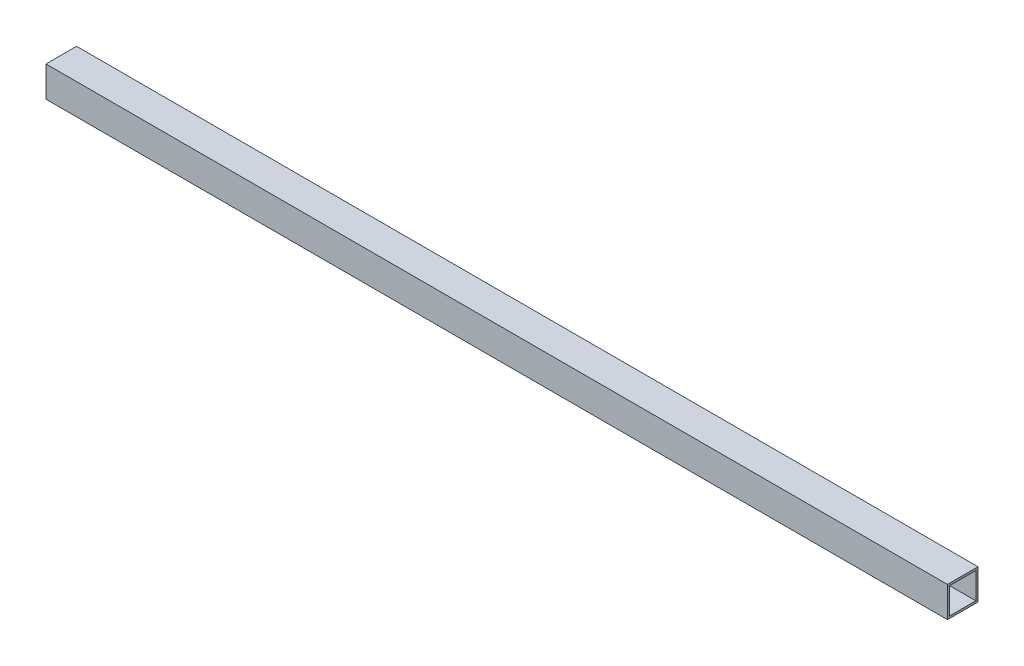
ISO-10303-21;
HEADER;
FILE_DESCRIPTION(('STEP AP214'),'2;1');
FILE_NAME('part.step','',(''),(''),'','','');
FILE_SCHEMA(('AUTOMOTIVE_DESIGN { 1 0 10303 214 1 1 1 1 }'));
ENDSEC;
DATA;
#1=APPLICATION_CONTEXT('core data for automotive mechanical design processes');
#2=APPLICATION_PROTOCOL_DEFINITION('international standard','automotive_design',2000,#1);
#3=PRODUCT_CONTEXT('',#1,'mechanical');
#4=PRODUCT('Part','Part','',(#3));
#5=PRODUCT_RELATED_PRODUCT_CATEGORY('part','',(#4));
#6=PRODUCT_DEFINITION_FORMATION('','',#4);
#7=PRODUCT_DEFINITION_CONTEXT('part definition',#1,'design');
#8=PRODUCT_DEFINITION('design','',#6,#7);
#9=PRODUCT_DEFINITION_SHAPE('','',#8);
#10=(LENGTH_UNIT() NAMED_UNIT(*) SI_UNIT(.MILLI.,.METRE.));
#11=(NAMED_UNIT(*) PLANE_ANGLE_UNIT() SI_UNIT($,.RADIAN.));
#12=(NAMED_UNIT(*) SI_UNIT($,.STERADIAN.) SOLID_ANGLE_UNIT());
#13=UNCERTAINTY_MEASURE_WITH_UNIT(LENGTH_MEASURE(1.E-05),#10,'distance_accuracy_value','');
#14=(GEOMETRIC_REPRESENTATION_CONTEXT(3) GLOBAL_UNCERTAINTY_ASSIGNED_CONTEXT((#13)) GLOBAL_UNIT_ASSIGNED_CONTEXT((#10,
#11,#12)) REPRESENTATION_CONTEXT('',''));
#15=CARTESIAN_POINT('',(0.,0.,0.));
#16=DIRECTION('',(0.,0.,1.));
#17=DIRECTION('',(1.,0.,0.));
#18=AXIS2_PLACEMENT_3D('',#15,#16,#17);
#19=CARTESIAN_POINT('',(-192.0875,-809.625,-19.05));
#20=DIRECTION('',(0.,0.,-1.));
#21=DIRECTION('',(-1.,0.,0.));
#22=AXIS2_PLACEMENT_3D('',#19,#20,#21);
#23=PLANE('',#22);
#24=DIRECTION('',(0.,1.,0.));
#25=VECTOR('',#24,1.);
#26=CARTESIAN_POINT('',(-847.725,-809.625,-19.05));
#27=LINE('',#26,#25);
#28=CARTESIAN_POINT('',(-847.725,-806.45,-19.05));
#29=VERTEX_POINT('',#28);
#30=CARTESIAN_POINT('',(-847.725,-768.35,-19.05));
#31=VERTEX_POINT('',#30);
#32=EDGE_CURVE('E127',#29,#31,#27,.T.);
#33=ORIENTED_EDGE('',*,*,#32,.F.);
#34=DIRECTION('',(1.,0.,0.));
#35=VECTOR('',#34,1.);
#36=CARTESIAN_POINT('',(-192.0875,-806.45,-19.05));
#37=LINE('',#36,#35);
#38=CARTESIAN_POINT('',(463.55,-806.45,-19.05));
#39=VERTEX_POINT('',#38);
#40=EDGE_CURVE('E89',#29,#39,#37,.T.);
#41=ORIENTED_EDGE('',*,*,#40,.T.);
#42=DIRECTION('',(0.,1.,0.));
#43=VECTOR('',#42,1.);
#44=CARTESIAN_POINT('',(463.55,-809.625,-19.05));
#45=LINE('',#44,#43);
#46=CARTESIAN_POINT('',(463.55,-768.35,-19.05));
#47=VERTEX_POINT('',#46);
#48=EDGE_CURVE('E99',#39,#47,#45,.T.);
#49=ORIENTED_EDGE('',*,*,#48,.T.);
#50=DIRECTION('',(1.,0.,0.));
#51=VECTOR('',#50,1.);
#52=CARTESIAN_POINT('',(-192.0875,-768.35,-19.05));
#53=LINE('',#52,#51);
#54=EDGE_CURVE('E17',#31,#47,#53,.T.);
#55=ORIENTED_EDGE('',*,*,#54,.F.);
#56=EDGE_LOOP('',(#33,#41,#49,#55));
#57=FACE_BOUND('',#56,.T.);
#58=ADVANCED_FACE('F14',(#57),#23,.F.);
#59=CARTESIAN_POINT('',(-192.0875,-768.35,0.));
#60=DIRECTION('',(0.,-1.,0.));
#61=DIRECTION('',(0.,0.,-1.));
#62=AXIS2_PLACEMENT_3D('',#59,#60,#61);
#63=PLANE('',#62);
#64=DIRECTION('',(-1.,0.,0.));
#65=VECTOR('',#64,1.);
#66=CARTESIAN_POINT('',(-192.0875,-768.35,19.05));
#67=LINE('',#66,#65);
#68=CARTESIAN_POINT('',(-847.725,-768.35,19.05));
#69=VERTEX_POINT('',#68);
#70=CARTESIAN_POINT('',(463.55,-768.35,19.05));
#71=VERTEX_POINT('',#70);
#72=EDGE_CURVE('E76',#69,#71,#67,.F.);
#73=ORIENTED_EDGE('',*,*,#72,.F.);
#74=DIRECTION('',(0.,0.,1.));
#75=VECTOR('',#74,1.);
#76=CARTESIAN_POINT('',(-847.725,-768.35,-1.00613961606655E-13));
#77=LINE('',#76,#75);
#78=EDGE_CURVE('E112',#31,#69,#77,.T.);
#79=ORIENTED_EDGE('',*,*,#78,.F.);
#80=ORIENTED_EDGE('',*,*,#54,.T.);
#81=DIRECTION('',(0.,0.,1.));
#82=VECTOR('',#81,1.);
#83=CARTESIAN_POINT('',(463.55,-768.35,0.));
#84=LINE('',#83,#82);
#85=EDGE_CURVE('E111',#47,#71,#84,.T.);
#86=ORIENTED_EDGE('',*,*,#85,.T.);
#87=EDGE_LOOP('',(#73,#79,#80,#86));
#88=FACE_BOUND('',#87,.T.);
#89=ADVANCED_FACE('F110',(#88),#63,.T.);
#90=CARTESIAN_POINT('',(-192.0875,-809.625,19.05));
#91=DIRECTION('',(0.,0.,-1.));
#92=DIRECTION('',(-1.,0.,0.));
#93=AXIS2_PLACEMENT_3D('',#90,#91,#92);
#94=PLANE('',#93);
#95=DIRECTION('',(1.,0.,0.));
#96=VECTOR('',#95,1.);
#97=CARTESIAN_POINT('',(-192.0875,-806.45,19.05));
#98=LINE('',#97,#96);
#99=CARTESIAN_POINT('',(463.55,-806.45,19.05));
#100=VERTEX_POINT('',#99);
#101=CARTESIAN_POINT('',(-847.725,-806.45,19.05));
#102=VERTEX_POINT('',#101);
#103=EDGE_CURVE('E83',#100,#102,#98,.F.);
#104=ORIENTED_EDGE('',*,*,#103,.T.);
#105=DIRECTION('',(0.,1.,0.));
#106=VECTOR('',#105,1.);
#107=CARTESIAN_POINT('',(-847.725,-809.625,19.05));
#108=LINE('',#107,#106);
#109=EDGE_CURVE('E130',#69,#102,#108,.F.);
#110=ORIENTED_EDGE('',*,*,#109,.F.);
#111=ORIENTED_EDGE('',*,*,#72,.T.);
#112=DIRECTION('',(0.,1.,0.));
#113=VECTOR('',#112,1.);
#114=CARTESIAN_POINT('',(463.55,-809.625,19.05));
#115=LINE('',#114,#113);
#116=EDGE_CURVE('E96',#71,#100,#115,.F.);
#117=ORIENTED_EDGE('',*,*,#116,.T.);
#118=EDGE_LOOP('',(#104,#110,#111,#117));
#119=FACE_BOUND('',#118,.T.);
#120=ADVANCED_FACE('F101',(#119),#94,.T.);
#121=CARTESIAN_POINT('',(-192.0875,-806.45,0.));
#122=DIRECTION('',(0.,-1.,0.));
#123=DIRECTION('',(0.,0.,-1.));
#124=AXIS2_PLACEMENT_3D('',#121,#122,#123);
#125=PLANE('',#124);
#126=DIRECTION('',(0.,0.,1.));
#127=VECTOR('',#126,1.);
#128=CARTESIAN_POINT('',(-847.725,-806.45,-1.00613961606655E-13));
#129=LINE('',#128,#127);
#130=EDGE_CURVE('E88',#102,#29,#129,.F.);
#131=ORIENTED_EDGE('',*,*,#130,.F.);
#132=ORIENTED_EDGE('',*,*,#103,.F.);
#133=DIRECTION('',(0.,0.,1.));
#134=VECTOR('',#133,1.);
#135=CARTESIAN_POINT('',(463.55,-806.45,0.));
#136=LINE('',#135,#134);
#137=EDGE_CURVE('E86',#100,#39,#136,.F.);
#138=ORIENTED_EDGE('',*,*,#137,.T.);
#139=ORIENTED_EDGE('',*,*,#40,.F.);
#140=EDGE_LOOP('',(#131,#132,#138,#139));
#141=FACE_BOUND('',#140,.T.);
#142=ADVANCED_FACE('F85',(#141),#125,.F.);
#143=CARTESIAN_POINT('',(-192.0875,-809.625,0.));
#144=DIRECTION('',(0.,-1.,0.));
#145=DIRECTION('',(0.,0.,-1.));
#146=AXIS2_PLACEMENT_3D('',#143,#144,#145);
#147=PLANE('',#146);
#148=DIRECTION('',(-1.,0.,0.));
#149=VECTOR('',#148,1.);
#150=CARTESIAN_POINT('',(-192.0875,-809.625,22.225));
#151=LINE('',#150,#149);
#152=CARTESIAN_POINT('',(463.55,-809.625,22.225));
#153=VERTEX_POINT('',#152);
#154=CARTESIAN_POINT('',(-847.725,-809.625,22.225));
#155=VERTEX_POINT('',#154);
#156=EDGE_CURVE('E120',#153,#155,#151,.T.);
#157=ORIENTED_EDGE('',*,*,#156,.T.);
#158=DIRECTION('',(0.,0.,1.));
#159=VECTOR('',#158,1.);
#160=CARTESIAN_POINT('',(-847.725,-809.625,-1.00613961606655E-13));
#161=LINE('',#160,#159);
#162=CARTESIAN_POINT('',(-847.725,-809.625,-22.225));
#163=VERTEX_POINT('',#162);
#164=EDGE_CURVE('E123',#163,#155,#161,.T.);
#165=ORIENTED_EDGE('',*,*,#164,.F.);
#166=DIRECTION('',(-1.,0.,0.));
#167=VECTOR('',#166,1.);
#168=CARTESIAN_POINT('',(-192.0875,-809.625,-22.225));
#169=LINE('',#168,#167);
#170=CARTESIAN_POINT('',(463.55,-809.625,-22.225));
#171=VERTEX_POINT('',#170);
#172=EDGE_CURVE('E136',#171,#163,#169,.T.);
#173=ORIENTED_EDGE('',*,*,#172,.F.);
#174=DIRECTION('',(0.,0.,1.));
#175=VECTOR('',#174,1.);
#176=CARTESIAN_POINT('',(463.55,-809.625,0.));
#177=LINE('',#176,#175);
#178=EDGE_CURVE('E102',#171,#153,#177,.T.);
#179=ORIENTED_EDGE('',*,*,#178,.T.);
#180=EDGE_LOOP('',(#157,#165,#173,#179));
#181=FACE_BOUND('',#180,.T.);
#182=ADVANCED_FACE('F175',(#181),#147,.T.);
#183=CARTESIAN_POINT('',(463.55,-809.625,0.));
#184=DIRECTION('',(-1.,0.,0.));
#185=DIRECTION('',(0.,0.,1.));
#186=AXIS2_PLACEMENT_3D('',#183,#184,#185);
#187=PLANE('',#186);
#188=ORIENTED_EDGE('',*,*,#48,.F.);
#189=ORIENTED_EDGE('',*,*,#137,.F.);
#190=ORIENTED_EDGE('',*,*,#116,.F.);
#191=ORIENTED_EDGE('',*,*,#85,.F.);
#192=EDGE_LOOP('',(#188,#189,#190,#191));
#193=FACE_BOUND('',#192,.T.);
#194=DIRECTION('',(0.,1.,0.));
#195=VECTOR('',#194,1.);
#196=CARTESIAN_POINT('',(463.55,-809.625,22.2250000000001));
#197=LINE('',#196,#195);
#198=CARTESIAN_POINT('',(463.55,-765.175,22.225));
#199=VERTEX_POINT('',#198);
#200=EDGE_CURVE('E115',#199,#153,#197,.F.);
#201=ORIENTED_EDGE('',*,*,#200,.T.);
#202=ORIENTED_EDGE('',*,*,#178,.F.);
#203=DIRECTION('',(0.,1.,0.));
#204=VECTOR('',#203,1.);
#205=CARTESIAN_POINT('',(463.55,-809.625,-22.2249999999999));
#206=LINE('',#205,#204);
#207=CARTESIAN_POINT('',(463.55,-765.175,-22.225));
#208=VERTEX_POINT('',#207);
#209=EDGE_CURVE('E133',#208,#171,#206,.F.);
#210=ORIENTED_EDGE('',*,*,#209,.F.);
#211=DIRECTION('',(0.,0.,-1.));
#212=VECTOR('',#211,1.);
#213=CARTESIAN_POINT('',(463.55,-765.175,0.));
#214=LINE('',#213,#212);
#215=EDGE_CURVE('E139',#208,#199,#214,.F.);
#216=ORIENTED_EDGE('',*,*,#215,.T.);
#217=EDGE_LOOP('',(#201,#202,#210,#216));
#218=FACE_BOUND('',#217,.T.);
#219=ADVANCED_FACE('F93',(#193,#218),#187,.F.);
#220=CARTESIAN_POINT('',(-192.0875,-809.625,22.225));
#221=DIRECTION('',(0.,0.,-1.));
#222=DIRECTION('',(-1.,0.,0.));
#223=AXIS2_PLACEMENT_3D('',#220,#221,#222);
#224=PLANE('',#223);
#225=DIRECTION('',(0.,1.,0.));
#226=VECTOR('',#225,1.);
#227=CARTESIAN_POINT('',(-847.725,-809.625,22.225));
#228=LINE('',#227,#226);
#229=CARTESIAN_POINT('',(-847.725,-765.175,22.225));
#230=VERTEX_POINT('',#229);
#231=EDGE_CURVE('E125',#155,#230,#228,.T.);
#232=ORIENTED_EDGE('',*,*,#231,.F.);
#233=ORIENTED_EDGE('',*,*,#156,.F.);
#234=ORIENTED_EDGE('',*,*,#200,.F.);
#235=DIRECTION('',(1.,0.,0.));
#236=VECTOR('',#235,1.);
#237=CARTESIAN_POINT('',(-192.0875,-765.175,22.225));
#238=LINE('',#237,#236);
#239=EDGE_CURVE('E142',#199,#230,#238,.F.);
#240=ORIENTED_EDGE('',*,*,#239,.T.);
#241=EDGE_LOOP('',(#232,#233,#234,#240));
#242=FACE_BOUND('',#241,.T.);
#243=ADVANCED_FACE('F154',(#242),#224,.F.);
#244=CARTESIAN_POINT('',(-847.725,-809.625,-1.00613961606655E-13));
#245=DIRECTION('',(-1.,0.,0.));
#246=DIRECTION('',(0.,0.,1.));
#247=AXIS2_PLACEMENT_3D('',#244,#245,#246);
#248=PLANE('',#247);
#249=ORIENTED_EDGE('',*,*,#109,.T.);
#250=ORIENTED_EDGE('',*,*,#130,.T.);
#251=ORIENTED_EDGE('',*,*,#32,.T.);
#252=ORIENTED_EDGE('',*,*,#78,.T.);
#253=EDGE_LOOP('',(#249,#250,#251,#252));
#254=FACE_BOUND('',#253,.T.);
#255=ORIENTED_EDGE('',*,*,#164,.T.);
#256=ORIENTED_EDGE('',*,*,#231,.T.);
#257=DIRECTION('',(0.,0.,-1.));
#258=VECTOR('',#257,1.);
#259=CARTESIAN_POINT('',(-847.725,-765.175,0.));
#260=LINE('',#259,#258);
#261=CARTESIAN_POINT('',(-847.725,-765.175,-22.225));
#262=VERTEX_POINT('',#261);
#263=EDGE_CURVE('E23',#230,#262,#260,.T.);
#264=ORIENTED_EDGE('',*,*,#263,.T.);
#265=DIRECTION('',(0.,1.,0.));
#266=VECTOR('',#265,1.);
#267=CARTESIAN_POINT('',(-847.725,-809.625,-22.2250000000001));
#268=LINE('',#267,#266);
#269=EDGE_CURVE('E31',#163,#262,#268,.T.);
#270=ORIENTED_EDGE('',*,*,#269,.F.);
#271=EDGE_LOOP('',(#255,#256,#264,#270));
#272=FACE_BOUND('',#271,.T.);
#273=ADVANCED_FACE('F148',(#254,#272),#248,.T.);
#274=CARTESIAN_POINT('',(-192.0875,-809.625,-22.225));
#275=DIRECTION('',(0.,0.,-1.));
#276=DIRECTION('',(-1.,0.,0.));
#277=AXIS2_PLACEMENT_3D('',#274,#275,#276);
#278=PLANE('',#277);
#279=ORIENTED_EDGE('',*,*,#172,.T.);
#280=ORIENTED_EDGE('',*,*,#269,.T.);
#281=DIRECTION('',(1.,0.,0.));
#282=VECTOR('',#281,1.);
#283=CARTESIAN_POINT('',(-192.0875,-765.175,-22.225));
#284=LINE('',#283,#282);
#285=EDGE_CURVE('E9',#262,#208,#284,.T.);
#286=ORIENTED_EDGE('',*,*,#285,.T.);
#287=ORIENTED_EDGE('',*,*,#209,.T.);
#288=EDGE_LOOP('',(#279,#280,#286,#287));
#289=FACE_BOUND('',#288,.T.);
#290=ADVANCED_FACE('F158',(#289),#278,.T.);
#291=CARTESIAN_POINT('',(-192.0875,-765.175,0.));
#292=DIRECTION('',(0.,-1.,0.));
#293=DIRECTION('',(0.,0.,-1.));
#294=AXIS2_PLACEMENT_3D('',#291,#292,#293);
#295=PLANE('',#294);
#296=ORIENTED_EDGE('',*,*,#263,.F.);
#297=ORIENTED_EDGE('',*,*,#239,.F.);
#298=ORIENTED_EDGE('',*,*,#215,.F.);
#299=ORIENTED_EDGE('',*,*,#285,.F.);
#300=EDGE_LOOP('',(#296,#297,#298,#299));
#301=FACE_BOUND('',#300,.T.);
#302=ADVANCED_FACE('F152',(#301),#295,.F.);
#303=CLOSED_SHELL('',(#58,#89,#120,#142,#182,#219,#243,#273,#290,#302));
#304=MANIFOLD_SOLID_BREP('B1',#303);
#305=ADVANCED_BREP_SHAPE_REPRESENTATION('',(#18,#304),#14);
#306=SHAPE_DEFINITION_REPRESENTATION(#9,#305);
ENDSEC;
END-ISO-10303-21;
